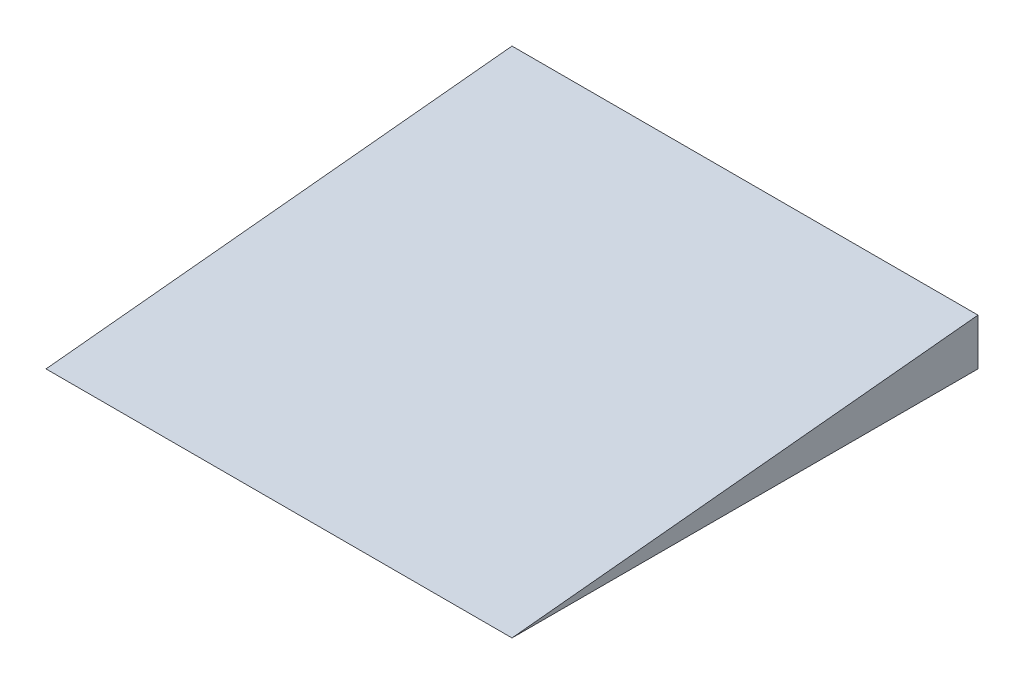
ISO-10303-21;
HEADER;
FILE_DESCRIPTION(('STEP AP214'),'2;1');
FILE_NAME('part.step','',(''),(''),'','','');
FILE_SCHEMA(('AUTOMOTIVE_DESIGN { 1 0 10303 214 1 1 1 1 }'));
ENDSEC;
DATA;
#1=APPLICATION_CONTEXT('core data for automotive mechanical design processes');
#2=APPLICATION_PROTOCOL_DEFINITION('international standard','automotive_design',2000,#1);
#3=PRODUCT_CONTEXT('',#1,'mechanical');
#4=PRODUCT('Part','Part','',(#3));
#5=PRODUCT_RELATED_PRODUCT_CATEGORY('part','',(#4));
#6=PRODUCT_DEFINITION_FORMATION('','',#4);
#7=PRODUCT_DEFINITION_CONTEXT('part definition',#1,'design');
#8=PRODUCT_DEFINITION('design','',#6,#7);
#9=PRODUCT_DEFINITION_SHAPE('','',#8);
#10=(LENGTH_UNIT() NAMED_UNIT(*) SI_UNIT(.MILLI.,.METRE.));
#11=(NAMED_UNIT(*) PLANE_ANGLE_UNIT() SI_UNIT($,.RADIAN.));
#12=(NAMED_UNIT(*) SI_UNIT($,.STERADIAN.) SOLID_ANGLE_UNIT());
#13=UNCERTAINTY_MEASURE_WITH_UNIT(LENGTH_MEASURE(1.E-05),#10,'distance_accuracy_value','');
#14=(GEOMETRIC_REPRESENTATION_CONTEXT(3) GLOBAL_UNCERTAINTY_ASSIGNED_CONTEXT((#13)) GLOBAL_UNIT_ASSIGNED_CONTEXT((#10,
#11,#12)) REPRESENTATION_CONTEXT('',''));
#15=CARTESIAN_POINT('',(0.,0.,0.));
#16=DIRECTION('',(0.,0.,1.));
#17=DIRECTION('',(1.,0.,0.));
#18=AXIS2_PLACEMENT_3D('',#15,#16,#17);
#19=CARTESIAN_POINT('',(0.,100.,0.));
#20=DIRECTION('',(1.,0.,0.));
#21=DIRECTION('',(0.,0.,-1.));
#22=AXIS2_PLACEMENT_3D('',#19,#20,#21);
#23=PLANE('',#22);
#24=DIRECTION('',(0.,0.,1.));
#25=VECTOR('',#24,1.);
#26=CARTESIAN_POINT('',(0.,0.,0.));
#27=LINE('',#26,#25);
#28=CARTESIAN_POINT('',(0.,0.,-1000.));
#29=VERTEX_POINT('',#28);
#30=CARTESIAN_POINT('',(0.,0.,0.));
#31=VERTEX_POINT('',#30);
#32=EDGE_CURVE('E80',#29,#31,#27,.T.);
#33=ORIENTED_EDGE('',*,*,#32,.T.);
#34=DIRECTION('',(0.,0.0995037190209989,-0.995037190209989));
#35=VECTOR('',#34,1.);
#36=CARTESIAN_POINT('',(0.,0.990099009900991,-9.9009900990099));
#37=LINE('',#36,#35);
#38=CARTESIAN_POINT('',(0.,100.,-1000.));
#39=VERTEX_POINT('',#38);
#40=EDGE_CURVE('E76',#31,#39,#37,.T.);
#41=ORIENTED_EDGE('',*,*,#40,.T.);
#42=DIRECTION('',(0.,-1.,0.));
#43=VECTOR('',#42,1.);
#44=CARTESIAN_POINT('',(0.,100.,-1000.));
#45=LINE('',#44,#43);
#46=EDGE_CURVE('E44',#39,#29,#45,.T.);
#47=ORIENTED_EDGE('',*,*,#46,.T.);
#48=EDGE_LOOP('',(#33,#41,#47));
#49=FACE_BOUND('',#48,.T.);
#50=ADVANCED_FACE('F37',(#49),#23,.F.);
#51=CARTESIAN_POINT('',(1000.,100.,0.));
#52=DIRECTION('',(-1.,0.,0.));
#53=DIRECTION('',(0.,0.,1.));
#54=AXIS2_PLACEMENT_3D('',#51,#52,#53);
#55=PLANE('',#54);
#56=DIRECTION('',(0.,-1.,0.));
#57=VECTOR('',#56,1.);
#58=CARTESIAN_POINT('',(1000.,100.,-1000.));
#59=LINE('',#58,#57);
#60=CARTESIAN_POINT('',(1000.,100.,-1000.));
#61=VERTEX_POINT('',#60);
#62=CARTESIAN_POINT('',(1000.,0.,-1000.));
#63=VERTEX_POINT('',#62);
#64=EDGE_CURVE('E11',#61,#63,#59,.T.);
#65=ORIENTED_EDGE('',*,*,#64,.F.);
#66=DIRECTION('',(0.,0.0995037190209989,-0.995037190209989));
#67=VECTOR('',#66,1.);
#68=CARTESIAN_POINT('',(1000.,0.,0.));
#69=LINE('',#68,#67);
#70=CARTESIAN_POINT('',(1000.,0.,0.));
#71=VERTEX_POINT('',#70);
#72=EDGE_CURVE('E74',#71,#61,#69,.T.);
#73=ORIENTED_EDGE('',*,*,#72,.F.);
#74=DIRECTION('',(0.,0.,-1.));
#75=VECTOR('',#74,1.);
#76=CARTESIAN_POINT('',(1000.,0.,0.));
#77=LINE('',#76,#75);
#78=EDGE_CURVE('E58',#71,#63,#77,.T.);
#79=ORIENTED_EDGE('',*,*,#78,.T.);
#80=EDGE_LOOP('',(#65,#73,#79));
#81=FACE_BOUND('',#80,.T.);
#82=ADVANCED_FACE('F82',(#81),#55,.F.);
#83=CARTESIAN_POINT('',(0.,100.,-1000.));
#84=DIRECTION('',(0.,0.,1.));
#85=DIRECTION('',(1.,0.,0.));
#86=AXIS2_PLACEMENT_3D('',#83,#84,#85);
#87=PLANE('',#86);
#88=DIRECTION('',(-1.,0.,0.));
#89=VECTOR('',#88,1.);
#90=CARTESIAN_POINT('',(0.,0.,-1000.));
#91=LINE('',#90,#89);
#92=EDGE_CURVE('E50',#63,#29,#91,.T.);
#93=ORIENTED_EDGE('',*,*,#92,.T.);
#94=ORIENTED_EDGE('',*,*,#46,.F.);
#95=DIRECTION('',(-1.,0.,0.));
#96=VECTOR('',#95,1.);
#97=CARTESIAN_POINT('',(0.,100.,-1000.));
#98=LINE('',#97,#96);
#99=EDGE_CURVE('E87',#61,#39,#98,.T.);
#100=ORIENTED_EDGE('',*,*,#99,.F.);
#101=ORIENTED_EDGE('',*,*,#64,.T.);
#102=EDGE_LOOP('',(#93,#94,#100,#101));
#103=FACE_BOUND('',#102,.T.);
#104=ADVANCED_FACE('F93',(#103),#87,.F.);
#105=CARTESIAN_POINT('',(0.,0.,0.));
#106=DIRECTION('',(0.,-1.,0.));
#107=DIRECTION('',(0.,0.,-1.));
#108=AXIS2_PLACEMENT_3D('',#105,#106,#107);
#109=PLANE('',#108);
#110=ORIENTED_EDGE('',*,*,#32,.F.);
#111=ORIENTED_EDGE('',*,*,#92,.F.);
#112=ORIENTED_EDGE('',*,*,#78,.F.);
#113=DIRECTION('',(1.,0.,0.));
#114=VECTOR('',#113,1.);
#115=CARTESIAN_POINT('',(0.,0.,0.));
#116=LINE('',#115,#114);
#117=EDGE_CURVE('E72',#31,#71,#116,.T.);
#118=ORIENTED_EDGE('',*,*,#117,.F.);
#119=EDGE_LOOP('',(#110,#111,#112,#118));
#120=FACE_BOUND('',#119,.T.);
#121=ADVANCED_FACE('F85',(#120),#109,.T.);
#122=CARTESIAN_POINT('',(-201.999999999999,0.,0.));
#123=DIRECTION('',(0.,-0.995037190209989,-0.0995037190209989));
#124=DIRECTION('',(0.,0.0995037190209989,-0.995037190209989));
#125=AXIS2_PLACEMENT_3D('',#122,#123,#124);
#126=PLANE('',#125);
#127=ORIENTED_EDGE('',*,*,#117,.T.);
#128=ORIENTED_EDGE('',*,*,#72,.T.);
#129=ORIENTED_EDGE('',*,*,#99,.T.);
#130=ORIENTED_EDGE('',*,*,#40,.F.);
#131=EDGE_LOOP('',(#127,#128,#129,#130));
#132=FACE_BOUND('',#131,.T.);
#133=ADVANCED_FACE('F73',(#132),#126,.F.);
#134=CLOSED_SHELL('',(#50,#82,#104,#121,#133));
#135=MANIFOLD_SOLID_BREP('B2',#134);
#136=ADVANCED_BREP_SHAPE_REPRESENTATION('',(#18,#135),#14);
#137=SHAPE_DEFINITION_REPRESENTATION(#9,#136);
ENDSEC;
END-ISO-10303-21;
